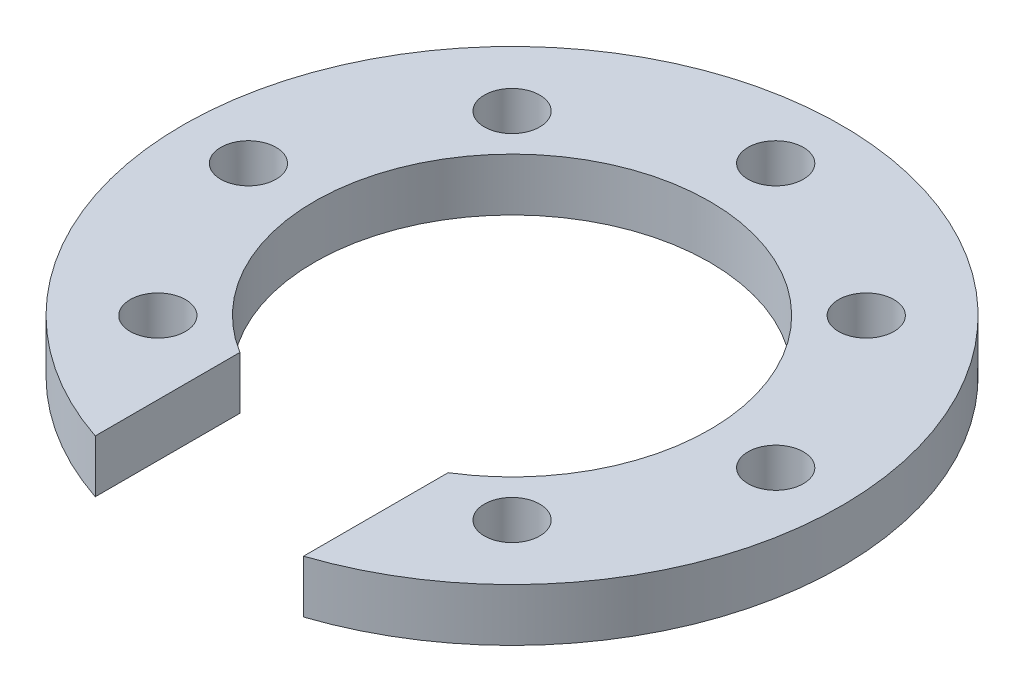
ISO-10303-21;
HEADER;
FILE_DESCRIPTION(('STEP AP214'),'2;1');
FILE_NAME('part.step','',(''),(''),'','','');
FILE_SCHEMA(('AUTOMOTIVE_DESIGN { 1 0 10303 214 1 1 1 1 }'));
ENDSEC;
DATA;
#1=APPLICATION_CONTEXT('core data for automotive mechanical design processes');
#2=APPLICATION_PROTOCOL_DEFINITION('international standard','automotive_design',2000,#1);
#3=PRODUCT_CONTEXT('',#1,'mechanical');
#4=PRODUCT('Part','Part','',(#3));
#5=PRODUCT_RELATED_PRODUCT_CATEGORY('part','',(#4));
#6=PRODUCT_DEFINITION_FORMATION('','',#4);
#7=PRODUCT_DEFINITION_CONTEXT('part definition',#1,'design');
#8=PRODUCT_DEFINITION('design','',#6,#7);
#9=PRODUCT_DEFINITION_SHAPE('','',#8);
#10=(LENGTH_UNIT() NAMED_UNIT(*) SI_UNIT(.MILLI.,.METRE.));
#11=(NAMED_UNIT(*) PLANE_ANGLE_UNIT() SI_UNIT($,.RADIAN.));
#12=(NAMED_UNIT(*) SI_UNIT($,.STERADIAN.) SOLID_ANGLE_UNIT());
#13=UNCERTAINTY_MEASURE_WITH_UNIT(LENGTH_MEASURE(1.E-05),#10,'distance_accuracy_value','');
#14=(GEOMETRIC_REPRESENTATION_CONTEXT(3) GLOBAL_UNCERTAINTY_ASSIGNED_CONTEXT((#13)) GLOBAL_UNIT_ASSIGNED_CONTEXT((#10,
#11,#12)) REPRESENTATION_CONTEXT('',''));
#15=CARTESIAN_POINT('',(0.,0.,0.));
#16=DIRECTION('',(0.,0.,1.));
#17=DIRECTION('',(1.,0.,0.));
#18=AXIS2_PLACEMENT_3D('',#15,#16,#17);
#19=CARTESIAN_POINT('',(0.,2.,0.));
#20=DIRECTION('',(0.,1.,0.));
#21=DIRECTION('',(0.,0.,1.));
#22=AXIS2_PLACEMENT_3D('',#19,#20,#21);
#23=PLANE('',#22);
#24=CARTESIAN_POINT('',(-6.71751442,2.,6.71751442));
#25=DIRECTION('',(0.,1.,0.));
#26=DIRECTION('',(0.,0.,1.));
#27=AXIS2_PLACEMENT_3D('',#24,#25,#26);
#28=CIRCLE('',#27,1.05);
#29=CARTESIAN_POINT('',(-6.71751442,2.,7.76751442));
#30=VERTEX_POINT('',#29);
#31=EDGE_CURVE('E136',#30,#30,#28,.T.);
#32=ORIENTED_EDGE('',*,*,#31,.F.);
#33=EDGE_LOOP('',(#32));
#34=FACE_BOUND('',#33,.T.);
#35=CARTESIAN_POINT('',(6.71751442,2.,6.71751442));
#36=DIRECTION('',(0.,1.,0.));
#37=DIRECTION('',(0.,0.,1.));
#38=AXIS2_PLACEMENT_3D('',#35,#36,#37);
#39=CIRCLE('',#38,1.05);
#40=CARTESIAN_POINT('',(6.71751442,2.,7.76751442));
#41=VERTEX_POINT('',#40);
#42=EDGE_CURVE('E147',#41,#41,#39,.T.);
#43=ORIENTED_EDGE('',*,*,#42,.F.);
#44=EDGE_LOOP('',(#43));
#45=FACE_BOUND('',#44,.T.);
#46=CARTESIAN_POINT('',(6.71751442,2.,-6.71751442));
#47=DIRECTION('',(0.,1.,0.));
#48=DIRECTION('',(0.,0.,1.));
#49=AXIS2_PLACEMENT_3D('',#46,#47,#48);
#50=CIRCLE('',#49,1.05);
#51=CARTESIAN_POINT('',(6.71751442,2.,-5.66751442));
#52=VERTEX_POINT('',#51);
#53=EDGE_CURVE('E141',#52,#52,#50,.T.);
#54=ORIENTED_EDGE('',*,*,#53,.F.);
#55=EDGE_LOOP('',(#54));
#56=FACE_BOUND('',#55,.T.);
#57=CARTESIAN_POINT('',(-6.71751442,2.,-6.71751442));
#58=DIRECTION('',(0.,1.,0.));
#59=DIRECTION('',(0.,0.,1.));
#60=AXIS2_PLACEMENT_3D('',#57,#58,#59);
#61=CIRCLE('',#60,1.05);
#62=CARTESIAN_POINT('',(-6.71751442,2.,-5.66751442));
#63=VERTEX_POINT('',#62);
#64=EDGE_CURVE('E140',#63,#63,#61,.T.);
#65=ORIENTED_EDGE('',*,*,#64,.F.);
#66=EDGE_LOOP('',(#65));
#67=FACE_BOUND('',#66,.T.);
#68=CARTESIAN_POINT('',(0.,2.,-10.));
#69=DIRECTION('',(0.,1.,0.));
#70=DIRECTION('',(1.,0.,0.));
#71=AXIS2_PLACEMENT_3D('',#68,#69,#70);
#72=CIRCLE('',#71,1.05);
#73=CARTESIAN_POINT('',(1.04999999999997,2.,-10.));
#74=VERTEX_POINT('',#73);
#75=EDGE_CURVE('E113',#74,#74,#72,.T.);
#76=ORIENTED_EDGE('',*,*,#75,.F.);
#77=EDGE_LOOP('',(#76));
#78=FACE_BOUND('',#77,.T.);
#79=CARTESIAN_POINT('',(-10.,2.,0.));
#80=DIRECTION('',(0.,1.,0.));
#81=DIRECTION('',(0.,0.,-1.));
#82=AXIS2_PLACEMENT_3D('',#79,#80,#81);
#83=CIRCLE('',#82,1.05);
#84=CARTESIAN_POINT('',(-10.,2.,-1.05));
#85=VERTEX_POINT('',#84);
#86=EDGE_CURVE('E122',#85,#85,#83,.T.);
#87=ORIENTED_EDGE('',*,*,#86,.F.);
#88=EDGE_LOOP('',(#87));
#89=FACE_BOUND('',#88,.T.);
#90=CARTESIAN_POINT('',(10.,2.,0.));
#91=DIRECTION('',(0.,1.,0.));
#92=DIRECTION('',(0.,0.,1.));
#93=AXIS2_PLACEMENT_3D('',#90,#91,#92);
#94=CIRCLE('',#93,1.05);
#95=CARTESIAN_POINT('',(10.,2.,1.05));
#96=VERTEX_POINT('',#95);
#97=EDGE_CURVE('E108',#96,#96,#94,.T.);
#98=ORIENTED_EDGE('',*,*,#97,.F.);
#99=EDGE_LOOP('',(#98));
#100=FACE_BOUND('',#99,.T.);
#101=CARTESIAN_POINT('',(0.,2.,0.));
#102=DIRECTION('',(0.,1.,0.));
#103=DIRECTION('',(0.,0.,1.));
#104=AXIS2_PLACEMENT_3D('',#101,#102,#103);
#105=CIRCLE('',#104,12.5);
#106=CARTESIAN_POINT('',(3.95,2.,11.8594898709852));
#107=VERTEX_POINT('',#106);
#108=CARTESIAN_POINT('',(-3.95,2.,11.8594898709852));
#109=VERTEX_POINT('',#108);
#110=EDGE_CURVE('E93',#107,#109,#105,.T.);
#111=ORIENTED_EDGE('',*,*,#110,.T.);
#112=DIRECTION('',(0.,0.,-1.));
#113=VECTOR('',#112,1.);
#114=CARTESIAN_POINT('',(-3.95,2.,0.));
#115=LINE('',#114,#113);
#116=CARTESIAN_POINT('',(-3.95,2.,6.37553919288401));
#117=VERTEX_POINT('',#116);
#118=EDGE_CURVE('E87',#109,#117,#115,.T.);
#119=ORIENTED_EDGE('',*,*,#118,.T.);
#120=CARTESIAN_POINT('',(0.,2.,0.));
#121=DIRECTION('',(0.,1.,0.));
#122=DIRECTION('',(0.,0.,1.));
#123=AXIS2_PLACEMENT_3D('',#120,#121,#122);
#124=CIRCLE('',#123,7.50000000000001);
#125=CARTESIAN_POINT('',(3.95,2.,6.37553919288401));
#126=VERTEX_POINT('',#125);
#127=EDGE_CURVE('E95',#126,#117,#124,.T.);
#128=ORIENTED_EDGE('',*,*,#127,.F.);
#129=DIRECTION('',(0.,0.,-1.));
#130=VECTOR('',#129,1.);
#131=CARTESIAN_POINT('',(3.95,2.,0.));
#132=LINE('',#131,#130);
#133=EDGE_CURVE('E62',#107,#126,#132,.T.);
#134=ORIENTED_EDGE('',*,*,#133,.F.);
#135=EDGE_LOOP('',(#111,#119,#128,#134));
#136=FACE_BOUND('',#135,.T.);
#137=ADVANCED_FACE('F40',(#34,#45,#56,#67,#78,#89,#100,#136),#23,.T.);
#138=CARTESIAN_POINT('',(0.,0.,0.));
#139=DIRECTION('',(0.,1.,0.));
#140=DIRECTION('',(0.,0.,1.));
#141=AXIS2_PLACEMENT_3D('',#138,#139,#140);
#142=PLANE('',#141);
#143=CARTESIAN_POINT('',(10.,0.,0.));
#144=DIRECTION('',(0.,1.,0.));
#145=DIRECTION('',(0.,0.,1.));
#146=AXIS2_PLACEMENT_3D('',#143,#144,#145);
#147=CIRCLE('',#146,1.05);
#148=CARTESIAN_POINT('',(10.,0.,1.05));
#149=VERTEX_POINT('',#148);
#150=EDGE_CURVE('E105',#149,#149,#147,.T.);
#151=ORIENTED_EDGE('',*,*,#150,.T.);
#152=EDGE_LOOP('',(#151));
#153=FACE_BOUND('',#152,.T.);
#154=CARTESIAN_POINT('',(-10.,0.,0.));
#155=DIRECTION('',(0.,1.,0.));
#156=DIRECTION('',(0.,0.,1.));
#157=AXIS2_PLACEMENT_3D('',#154,#155,#156);
#158=CIRCLE('',#157,1.05);
#159=CARTESIAN_POINT('',(-10.,0.,1.05));
#160=VERTEX_POINT('',#159);
#161=EDGE_CURVE('E109',#160,#160,#158,.T.);
#162=ORIENTED_EDGE('',*,*,#161,.T.);
#163=EDGE_LOOP('',(#162));
#164=FACE_BOUND('',#163,.T.);
#165=CARTESIAN_POINT('',(0.,0.,-10.));
#166=DIRECTION('',(0.,1.,0.));
#167=DIRECTION('',(0.,0.,1.));
#168=AXIS2_PLACEMENT_3D('',#165,#166,#167);
#169=CIRCLE('',#168,1.05);
#170=CARTESIAN_POINT('',(0.,0.,-8.95));
#171=VERTEX_POINT('',#170);
#172=EDGE_CURVE('E112',#171,#171,#169,.T.);
#173=ORIENTED_EDGE('',*,*,#172,.T.);
#174=EDGE_LOOP('',(#173));
#175=FACE_BOUND('',#174,.T.);
#176=CARTESIAN_POINT('',(-6.71751442,0.,-6.71751442));
#177=DIRECTION('',(0.,1.,0.));
#178=DIRECTION('',(0.,0.,1.));
#179=AXIS2_PLACEMENT_3D('',#176,#177,#178);
#180=CIRCLE('',#179,1.05);
#181=CARTESIAN_POINT('',(-6.71751442,0.,-5.66751442));
#182=VERTEX_POINT('',#181);
#183=EDGE_CURVE('E155',#182,#182,#180,.T.);
#184=ORIENTED_EDGE('',*,*,#183,.T.);
#185=EDGE_LOOP('',(#184));
#186=FACE_BOUND('',#185,.T.);
#187=CARTESIAN_POINT('',(6.71751442,0.,-6.71751442));
#188=DIRECTION('',(0.,1.,0.));
#189=DIRECTION('',(0.,0.,1.));
#190=AXIS2_PLACEMENT_3D('',#187,#188,#189);
#191=CIRCLE('',#190,1.05);
#192=CARTESIAN_POINT('',(6.71751442,0.,-5.66751442));
#193=VERTEX_POINT('',#192);
#194=EDGE_CURVE('E137',#193,#193,#191,.T.);
#195=ORIENTED_EDGE('',*,*,#194,.T.);
#196=EDGE_LOOP('',(#195));
#197=FACE_BOUND('',#196,.T.);
#198=CARTESIAN_POINT('',(6.71751442,0.,6.71751442));
#199=DIRECTION('',(0.,1.,0.));
#200=DIRECTION('',(0.,0.,1.));
#201=AXIS2_PLACEMENT_3D('',#198,#199,#200);
#202=CIRCLE('',#201,1.05);
#203=CARTESIAN_POINT('',(6.71751442,0.,7.76751442));
#204=VERTEX_POINT('',#203);
#205=EDGE_CURVE('E144',#204,#204,#202,.T.);
#206=ORIENTED_EDGE('',*,*,#205,.T.);
#207=EDGE_LOOP('',(#206));
#208=FACE_BOUND('',#207,.T.);
#209=CARTESIAN_POINT('',(-6.71751442,0.,6.71751442));
#210=DIRECTION('',(0.,1.,0.));
#211=DIRECTION('',(0.,0.,1.));
#212=AXIS2_PLACEMENT_3D('',#209,#210,#211);
#213=CIRCLE('',#212,1.05);
#214=CARTESIAN_POINT('',(-6.71751442,0.,7.76751442));
#215=VERTEX_POINT('',#214);
#216=EDGE_CURVE('E150',#215,#215,#213,.T.);
#217=ORIENTED_EDGE('',*,*,#216,.T.);
#218=EDGE_LOOP('',(#217));
#219=FACE_BOUND('',#218,.T.);
#220=DIRECTION('',(0.,0.,-1.));
#221=VECTOR('',#220,1.);
#222=CARTESIAN_POINT('',(-3.95,0.,0.));
#223=LINE('',#222,#221);
#224=CARTESIAN_POINT('',(-3.95,0.,11.8594898709852));
#225=VERTEX_POINT('',#224);
#226=CARTESIAN_POINT('',(-3.95,0.,6.37553919288401));
#227=VERTEX_POINT('',#226);
#228=EDGE_CURVE('E55',#225,#227,#223,.T.);
#229=ORIENTED_EDGE('',*,*,#228,.F.);
#230=CARTESIAN_POINT('',(0.,0.,0.));
#231=DIRECTION('',(0.,1.,0.));
#232=DIRECTION('',(0.,0.,1.));
#233=AXIS2_PLACEMENT_3D('',#230,#231,#232);
#234=CIRCLE('',#233,12.5);
#235=CARTESIAN_POINT('',(3.95,0.,11.8594898709852));
#236=VERTEX_POINT('',#235);
#237=EDGE_CURVE('E98',#236,#225,#234,.T.);
#238=ORIENTED_EDGE('',*,*,#237,.F.);
#239=DIRECTION('',(0.,0.,-1.));
#240=VECTOR('',#239,1.);
#241=CARTESIAN_POINT('',(3.95,0.,0.));
#242=LINE('',#241,#240);
#243=CARTESIAN_POINT('',(3.95,0.,6.37553919288401));
#244=VERTEX_POINT('',#243);
#245=EDGE_CURVE('E81',#236,#244,#242,.T.);
#246=ORIENTED_EDGE('',*,*,#245,.T.);
#247=CARTESIAN_POINT('',(0.,0.,0.));
#248=DIRECTION('',(0.,1.,0.));
#249=DIRECTION('',(0.,0.,1.));
#250=AXIS2_PLACEMENT_3D('',#247,#248,#249);
#251=CIRCLE('',#250,7.50000000000001);
#252=EDGE_CURVE('E102',#244,#227,#251,.T.);
#253=ORIENTED_EDGE('',*,*,#252,.T.);
#254=EDGE_LOOP('',(#229,#238,#246,#253));
#255=FACE_BOUND('',#254,.T.);
#256=ADVANCED_FACE('F128',(#153,#164,#175,#186,#197,#208,#219,#255),#142,.F.);
#257=CARTESIAN_POINT('',(0.,2.,0.));
#258=DIRECTION('',(0.,-1.,0.));
#259=DIRECTION('',(0.,0.,-1.));
#260=AXIS2_PLACEMENT_3D('',#257,#258,#259);
#261=CYLINDRICAL_SURFACE('',#260,12.5);
#262=DIRECTION('',(0.,1.,0.));
#263=VECTOR('',#262,1.);
#264=CARTESIAN_POINT('',(-3.95,-8.,11.8594898709852));
#265=LINE('',#264,#263);
#266=EDGE_CURVE('E86',#225,#109,#265,.T.);
#267=ORIENTED_EDGE('',*,*,#266,.T.);
#268=ORIENTED_EDGE('',*,*,#110,.F.);
#269=DIRECTION('',(0.,1.,0.));
#270=VECTOR('',#269,1.);
#271=CARTESIAN_POINT('',(3.95,-8.,11.8594898709852));
#272=LINE('',#271,#270);
#273=EDGE_CURVE('E78',#236,#107,#272,.T.);
#274=ORIENTED_EDGE('',*,*,#273,.F.);
#275=ORIENTED_EDGE('',*,*,#237,.T.);
#276=EDGE_LOOP('',(#267,#268,#274,#275));
#277=FACE_BOUND('',#276,.T.);
#278=ADVANCED_FACE('F42',(#277),#261,.T.);
#279=CARTESIAN_POINT('',(0.,2.,0.));
#280=DIRECTION('',(0.,-1.,0.));
#281=DIRECTION('',(0.,0.,-1.));
#282=AXIS2_PLACEMENT_3D('',#279,#280,#281);
#283=CYLINDRICAL_SURFACE('',#282,7.50000000000001);
#284=ORIENTED_EDGE('',*,*,#127,.T.);
#285=DIRECTION('',(0.,-1.,0.));
#286=VECTOR('',#285,1.);
#287=CARTESIAN_POINT('',(-3.95,2.,6.37553919288401));
#288=LINE('',#287,#286);
#289=EDGE_CURVE('E11',#117,#227,#288,.T.);
#290=ORIENTED_EDGE('',*,*,#289,.T.);
#291=ORIENTED_EDGE('',*,*,#252,.F.);
#292=DIRECTION('',(0.,-1.,0.));
#293=VECTOR('',#292,1.);
#294=CARTESIAN_POINT('',(3.95,2.,6.37553919288401));
#295=LINE('',#294,#293);
#296=EDGE_CURVE('E48',#126,#244,#295,.T.);
#297=ORIENTED_EDGE('',*,*,#296,.F.);
#298=EDGE_LOOP('',(#284,#290,#291,#297));
#299=FACE_BOUND('',#298,.T.);
#300=ADVANCED_FACE('F129',(#299),#283,.F.);
#301=CARTESIAN_POINT('',(10.,-3.,0.));
#302=DIRECTION('',(0.,1.,0.));
#303=DIRECTION('',(0.,0.,1.));
#304=AXIS2_PLACEMENT_3D('',#301,#302,#303);
#305=CYLINDRICAL_SURFACE('',#304,1.05);
#306=ORIENTED_EDGE('',*,*,#97,.T.);
#307=EDGE_LOOP('',(#306));
#308=FACE_BOUND('',#307,.T.);
#309=ORIENTED_EDGE('',*,*,#150,.F.);
#310=EDGE_LOOP('',(#309));
#311=FACE_BOUND('',#310,.T.);
#312=ADVANCED_FACE('F181',(#308,#311),#305,.F.);
#313=CARTESIAN_POINT('',(-10.,-3.,0.));
#314=DIRECTION('',(0.,1.,0.));
#315=DIRECTION('',(0.,0.,1.));
#316=AXIS2_PLACEMENT_3D('',#313,#314,#315);
#317=CYLINDRICAL_SURFACE('',#316,1.05);
#318=ORIENTED_EDGE('',*,*,#86,.T.);
#319=EDGE_LOOP('',(#318));
#320=FACE_BOUND('',#319,.T.);
#321=ORIENTED_EDGE('',*,*,#161,.F.);
#322=EDGE_LOOP('',(#321));
#323=FACE_BOUND('',#322,.T.);
#324=ADVANCED_FACE('F165',(#320,#323),#317,.F.);
#325=CARTESIAN_POINT('',(0.,-3.,-10.));
#326=DIRECTION('',(0.,1.,0.));
#327=DIRECTION('',(0.,0.,1.));
#328=AXIS2_PLACEMENT_3D('',#325,#326,#327);
#329=CYLINDRICAL_SURFACE('',#328,1.05);
#330=ORIENTED_EDGE('',*,*,#75,.T.);
#331=EDGE_LOOP('',(#330));
#332=FACE_BOUND('',#331,.T.);
#333=ORIENTED_EDGE('',*,*,#172,.F.);
#334=EDGE_LOOP('',(#333));
#335=FACE_BOUND('',#334,.T.);
#336=ADVANCED_FACE('F186',(#332,#335),#329,.F.);
#337=CARTESIAN_POINT('',(-6.71751442,0.,-6.71751442));
#338=DIRECTION('',(0.,1.,0.));
#339=DIRECTION('',(0.,0.,1.));
#340=AXIS2_PLACEMENT_3D('',#337,#338,#339);
#341=CYLINDRICAL_SURFACE('',#340,1.05);
#342=ORIENTED_EDGE('',*,*,#183,.F.);
#343=EDGE_LOOP('',(#342));
#344=FACE_BOUND('',#343,.T.);
#345=ORIENTED_EDGE('',*,*,#64,.T.);
#346=EDGE_LOOP('',(#345));
#347=FACE_BOUND('',#346,.T.);
#348=ADVANCED_FACE('F189',(#344,#347),#341,.F.);
#349=CARTESIAN_POINT('',(6.71751442,0.,-6.71751442));
#350=DIRECTION('',(0.,1.,0.));
#351=DIRECTION('',(0.,0.,1.));
#352=AXIS2_PLACEMENT_3D('',#349,#350,#351);
#353=CYLINDRICAL_SURFACE('',#352,1.05);
#354=ORIENTED_EDGE('',*,*,#194,.F.);
#355=EDGE_LOOP('',(#354));
#356=FACE_BOUND('',#355,.T.);
#357=ORIENTED_EDGE('',*,*,#53,.T.);
#358=EDGE_LOOP('',(#357));
#359=FACE_BOUND('',#358,.T.);
#360=ADVANCED_FACE('F192',(#356,#359),#353,.F.);
#361=CARTESIAN_POINT('',(6.71751442,0.,6.71751442));
#362=DIRECTION('',(0.,1.,0.));
#363=DIRECTION('',(0.,0.,1.));
#364=AXIS2_PLACEMENT_3D('',#361,#362,#363);
#365=CYLINDRICAL_SURFACE('',#364,1.05);
#366=ORIENTED_EDGE('',*,*,#205,.F.);
#367=EDGE_LOOP('',(#366));
#368=FACE_BOUND('',#367,.T.);
#369=ORIENTED_EDGE('',*,*,#42,.T.);
#370=EDGE_LOOP('',(#369));
#371=FACE_BOUND('',#370,.T.);
#372=ADVANCED_FACE('F197',(#368,#371),#365,.F.);
#373=CARTESIAN_POINT('',(-6.71751442,0.,6.71751442));
#374=DIRECTION('',(0.,1.,0.));
#375=DIRECTION('',(0.,0.,1.));
#376=AXIS2_PLACEMENT_3D('',#373,#374,#375);
#377=CYLINDRICAL_SURFACE('',#376,1.05);
#378=ORIENTED_EDGE('',*,*,#216,.F.);
#379=EDGE_LOOP('',(#378));
#380=FACE_BOUND('',#379,.T.);
#381=ORIENTED_EDGE('',*,*,#31,.T.);
#382=EDGE_LOOP('',(#381));
#383=FACE_BOUND('',#382,.T.);
#384=ADVANCED_FACE('F194',(#380,#383),#377,.F.);
#385=CARTESIAN_POINT('',(3.95,-8.,0.));
#386=DIRECTION('',(1.,0.,0.));
#387=DIRECTION('',(0.,0.,-1.));
#388=AXIS2_PLACEMENT_3D('',#385,#386,#387);
#389=PLANE('',#388);
#390=ORIENTED_EDGE('',*,*,#273,.T.);
#391=ORIENTED_EDGE('',*,*,#133,.T.);
#392=ORIENTED_EDGE('',*,*,#296,.T.);
#393=ORIENTED_EDGE('',*,*,#245,.F.);
#394=EDGE_LOOP('',(#390,#391,#392,#393));
#395=FACE_BOUND('',#394,.T.);
#396=ADVANCED_FACE('F79',(#395),#389,.F.);
#397=CARTESIAN_POINT('',(-3.95,-8.,0.));
#398=DIRECTION('',(1.,0.,0.));
#399=DIRECTION('',(0.,0.,-1.));
#400=AXIS2_PLACEMENT_3D('',#397,#398,#399);
#401=PLANE('',#400);
#402=ORIENTED_EDGE('',*,*,#228,.T.);
#403=ORIENTED_EDGE('',*,*,#289,.F.);
#404=ORIENTED_EDGE('',*,*,#118,.F.);
#405=ORIENTED_EDGE('',*,*,#266,.F.);
#406=EDGE_LOOP('',(#402,#403,#404,#405));
#407=FACE_BOUND('',#406,.T.);
#408=ADVANCED_FACE('F130',(#407),#401,.T.);
#409=CLOSED_SHELL('',(#137,#256,#278,#300,#312,#324,#336,#348,#360,#372,#384,#396,#408));
#410=MANIFOLD_SOLID_BREP('B2',#409);
#411=ADVANCED_BREP_SHAPE_REPRESENTATION('',(#18,#410),#14);
#412=SHAPE_DEFINITION_REPRESENTATION(#9,#411);
ENDSEC;
END-ISO-10303-21;
